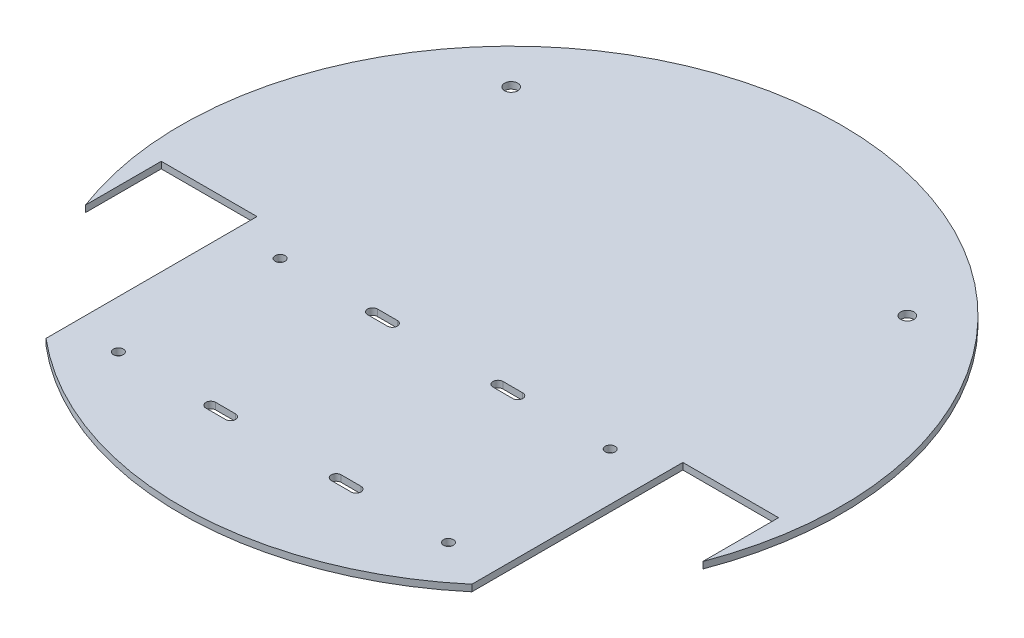
ISO-10303-21;
HEADER;
FILE_DESCRIPTION(('STEP AP214'),'2;1');
FILE_NAME('part.step','',(''),(''),'','','');
FILE_SCHEMA(('AUTOMOTIVE_DESIGN { 1 0 10303 214 1 1 1 1 }'));
ENDSEC;
DATA;
#1=APPLICATION_CONTEXT('core data for automotive mechanical design processes');
#2=APPLICATION_PROTOCOL_DEFINITION('international standard','automotive_design',2000,#1);
#3=PRODUCT_CONTEXT('',#1,'mechanical');
#4=PRODUCT('Part','Part','',(#3));
#5=PRODUCT_RELATED_PRODUCT_CATEGORY('part','',(#4));
#6=PRODUCT_DEFINITION_FORMATION('','',#4);
#7=PRODUCT_DEFINITION_CONTEXT('part definition',#1,'design');
#8=PRODUCT_DEFINITION('design','',#6,#7);
#9=PRODUCT_DEFINITION_SHAPE('','',#8);
#10=(LENGTH_UNIT() NAMED_UNIT(*) SI_UNIT(.MILLI.,.METRE.));
#11=(NAMED_UNIT(*) PLANE_ANGLE_UNIT() SI_UNIT($,.RADIAN.));
#12=(NAMED_UNIT(*) SI_UNIT($,.STERADIAN.) SOLID_ANGLE_UNIT());
#13=UNCERTAINTY_MEASURE_WITH_UNIT(LENGTH_MEASURE(1.E-05),#10,'distance_accuracy_value','');
#14=(GEOMETRIC_REPRESENTATION_CONTEXT(3) GLOBAL_UNCERTAINTY_ASSIGNED_CONTEXT((#13)) GLOBAL_UNIT_ASSIGNED_CONTEXT((#10,
#11,#12)) REPRESENTATION_CONTEXT('',''));
#15=CARTESIAN_POINT('',(0.,0.,0.));
#16=DIRECTION('',(0.,0.,1.));
#17=DIRECTION('',(1.,0.,0.));
#18=AXIS2_PLACEMENT_3D('',#15,#16,#17);
#19=CARTESIAN_POINT('',(22.0000000000001,2.,69.));
#20=DIRECTION('',(0.,-1.,0.));
#21=DIRECTION('',(0.,0.,-1.));
#22=AXIS2_PLACEMENT_3D('',#19,#20,#21);
#23=CYLINDRICAL_SURFACE('',#22,1.49999999999999);
#24=CARTESIAN_POINT('',(22.0000000000001,0.,69.));
#25=DIRECTION('',(0.,1.,0.));
#26=DIRECTION('',(0.,0.,1.));
#27=AXIS2_PLACEMENT_3D('',#24,#25,#26);
#28=CIRCLE('',#27,1.49999999999999);
#29=CARTESIAN_POINT('',(22.0000000000001,0.,70.5));
#30=VERTEX_POINT('',#29);
#31=CARTESIAN_POINT('',(22.0000000000001,0.,67.5));
#32=VERTEX_POINT('',#31);
#33=EDGE_CURVE('E303',#30,#32,#28,.T.);
#34=ORIENTED_EDGE('',*,*,#33,.F.);
#35=DIRECTION('',(0.,-1.,0.));
#36=VECTOR('',#35,1.);
#37=CARTESIAN_POINT('',(22.0000000000001,2.,70.5));
#38=LINE('',#37,#36);
#39=CARTESIAN_POINT('',(22.0000000000001,2.,70.5));
#40=VERTEX_POINT('',#39);
#41=EDGE_CURVE('E11',#40,#30,#38,.T.);
#42=ORIENTED_EDGE('',*,*,#41,.F.);
#43=CARTESIAN_POINT('',(22.0000000000001,2.,69.));
#44=DIRECTION('',(0.,1.,0.));
#45=DIRECTION('',(0.,0.,1.));
#46=AXIS2_PLACEMENT_3D('',#43,#44,#45);
#47=CIRCLE('',#46,1.49999999999999);
#48=CARTESIAN_POINT('',(22.0000000000001,2.,67.5));
#49=VERTEX_POINT('',#48);
#50=EDGE_CURVE('E221',#40,#49,#47,.T.);
#51=ORIENTED_EDGE('',*,*,#50,.T.);
#52=DIRECTION('',(0.,-1.,0.));
#53=VECTOR('',#52,1.);
#54=CARTESIAN_POINT('',(22.0000000000001,2.,67.5));
#55=LINE('',#54,#53);
#56=EDGE_CURVE('E136',#49,#32,#55,.T.);
#57=ORIENTED_EDGE('',*,*,#56,.T.);
#58=EDGE_LOOP('',(#34,#42,#51,#57));
#59=FACE_BOUND('',#58,.T.);
#60=ADVANCED_FACE('F35',(#59),#23,.F.);
#61=CARTESIAN_POINT('',(0.,2.,70.5));
#62=DIRECTION('',(0.,0.,-1.));
#63=DIRECTION('',(-1.,0.,0.));
#64=AXIS2_PLACEMENT_3D('',#61,#62,#63);
#65=PLANE('',#64);
#66=DIRECTION('',(1.,0.,0.));
#67=VECTOR('',#66,1.);
#68=CARTESIAN_POINT('',(0.,0.,70.5));
#69=LINE('',#68,#67);
#70=CARTESIAN_POINT('',(16.0000000000001,0.,70.5));
#71=VERTEX_POINT('',#70);
#72=EDGE_CURVE('E212',#71,#30,#69,.T.);
#73=ORIENTED_EDGE('',*,*,#72,.F.);
#74=DIRECTION('',(0.,-1.,0.));
#75=VECTOR('',#74,1.);
#76=CARTESIAN_POINT('',(16.0000000000001,2.,70.5));
#77=LINE('',#76,#75);
#78=CARTESIAN_POINT('',(16.0000000000001,2.,70.5));
#79=VERTEX_POINT('',#78);
#80=EDGE_CURVE('E45',#79,#71,#77,.T.);
#81=ORIENTED_EDGE('',*,*,#80,.F.);
#82=DIRECTION('',(1.,0.,0.));
#83=VECTOR('',#82,1.);
#84=CARTESIAN_POINT('',(0.,2.,70.5));
#85=LINE('',#84,#83);
#86=EDGE_CURVE('E210',#79,#40,#85,.T.);
#87=ORIENTED_EDGE('',*,*,#86,.T.);
#88=ORIENTED_EDGE('',*,*,#41,.T.);
#89=EDGE_LOOP('',(#73,#81,#87,#88));
#90=FACE_BOUND('',#89,.T.);
#91=ADVANCED_FACE('F209',(#90),#65,.T.);
#92=CARTESIAN_POINT('',(16.,2.,69.));
#93=DIRECTION('',(0.,-1.,0.));
#94=DIRECTION('',(0.,0.,-1.));
#95=AXIS2_PLACEMENT_3D('',#92,#93,#94);
#96=CYLINDRICAL_SURFACE('',#95,1.49999999999999);
#97=CARTESIAN_POINT('',(16.,0.,69.));
#98=DIRECTION('',(0.,1.,0.));
#99=DIRECTION('',(0.,0.,1.));
#100=AXIS2_PLACEMENT_3D('',#97,#98,#99);
#101=CIRCLE('',#100,1.49999999999999);
#102=CARTESIAN_POINT('',(16.0000000000001,0.,67.5));
#103=VERTEX_POINT('',#102);
#104=EDGE_CURVE('E307',#103,#71,#101,.T.);
#105=ORIENTED_EDGE('',*,*,#104,.F.);
#106=DIRECTION('',(0.,-1.,0.));
#107=VECTOR('',#106,1.);
#108=CARTESIAN_POINT('',(16.0000000000001,2.,67.5));
#109=LINE('',#108,#107);
#110=CARTESIAN_POINT('',(16.0000000000001,2.,67.5));
#111=VERTEX_POINT('',#110);
#112=EDGE_CURVE('E129',#111,#103,#109,.T.);
#113=ORIENTED_EDGE('',*,*,#112,.F.);
#114=CARTESIAN_POINT('',(16.,2.,69.));
#115=DIRECTION('',(0.,1.,0.));
#116=DIRECTION('',(0.,0.,1.));
#117=AXIS2_PLACEMENT_3D('',#114,#115,#116);
#118=CIRCLE('',#117,1.49999999999999);
#119=EDGE_CURVE('E220',#111,#79,#118,.T.);
#120=ORIENTED_EDGE('',*,*,#119,.T.);
#121=ORIENTED_EDGE('',*,*,#80,.T.);
#122=EDGE_LOOP('',(#105,#113,#120,#121));
#123=FACE_BOUND('',#122,.T.);
#124=ADVANCED_FACE('F223',(#123),#96,.F.);
#125=CARTESIAN_POINT('',(-22.,2.,20.));
#126=DIRECTION('',(0.,-1.,0.));
#127=DIRECTION('',(0.,0.,-1.));
#128=AXIS2_PLACEMENT_3D('',#125,#126,#127);
#129=CYLINDRICAL_SURFACE('',#128,1.5);
#130=CARTESIAN_POINT('',(-22.,0.,20.));
#131=DIRECTION('',(0.,1.,0.));
#132=DIRECTION('',(0.,0.,1.));
#133=AXIS2_PLACEMENT_3D('',#130,#131,#132);
#134=CIRCLE('',#133,1.5);
#135=CARTESIAN_POINT('',(-22.,0.,18.5));
#136=VERTEX_POINT('',#135);
#137=CARTESIAN_POINT('',(-22.,0.,21.5));
#138=VERTEX_POINT('',#137);
#139=EDGE_CURVE('E291',#136,#138,#134,.T.);
#140=ORIENTED_EDGE('',*,*,#139,.F.);
#141=DIRECTION('',(0.,-1.,0.));
#142=VECTOR('',#141,1.);
#143=CARTESIAN_POINT('',(-22.,2.,18.5));
#144=LINE('',#143,#142);
#145=CARTESIAN_POINT('',(-22.,2.,18.5));
#146=VERTEX_POINT('',#145);
#147=EDGE_CURVE('E325',#146,#136,#144,.T.);
#148=ORIENTED_EDGE('',*,*,#147,.F.);
#149=CARTESIAN_POINT('',(-22.,2.,20.));
#150=DIRECTION('',(0.,1.,0.));
#151=DIRECTION('',(0.,0.,1.));
#152=AXIS2_PLACEMENT_3D('',#149,#150,#151);
#153=CIRCLE('',#152,1.5);
#154=CARTESIAN_POINT('',(-22.,2.,21.5));
#155=VERTEX_POINT('',#154);
#156=EDGE_CURVE('E447',#146,#155,#153,.T.);
#157=ORIENTED_EDGE('',*,*,#156,.T.);
#158=DIRECTION('',(0.,-1.,0.));
#159=VECTOR('',#158,1.);
#160=CARTESIAN_POINT('',(-22.,2.,21.5));
#161=LINE('',#160,#159);
#162=EDGE_CURVE('E327',#155,#138,#161,.T.);
#163=ORIENTED_EDGE('',*,*,#162,.T.);
#164=EDGE_LOOP('',(#140,#148,#157,#163));
#165=FACE_BOUND('',#164,.T.);
#166=ADVANCED_FACE('F490',(#165),#129,.F.);
#167=CARTESIAN_POINT('',(0.,2.,18.5));
#168=DIRECTION('',(0.,0.,1.));
#169=DIRECTION('',(1.,0.,0.));
#170=AXIS2_PLACEMENT_3D('',#167,#168,#169);
#171=PLANE('',#170);
#172=DIRECTION('',(-1.,0.,0.));
#173=VECTOR('',#172,1.);
#174=CARTESIAN_POINT('',(0.,0.,18.5));
#175=LINE('',#174,#173);
#176=CARTESIAN_POINT('',(-16.,0.,18.5));
#177=VERTEX_POINT('',#176);
#178=EDGE_CURVE('E294',#177,#136,#175,.T.);
#179=ORIENTED_EDGE('',*,*,#178,.F.);
#180=DIRECTION('',(0.,-1.,0.));
#181=VECTOR('',#180,1.);
#182=CARTESIAN_POINT('',(-16.,2.,18.5));
#183=LINE('',#182,#181);
#184=CARTESIAN_POINT('',(-16.,2.,18.5));
#185=VERTEX_POINT('',#184);
#186=EDGE_CURVE('E332',#185,#177,#183,.T.);
#187=ORIENTED_EDGE('',*,*,#186,.F.);
#188=DIRECTION('',(-1.,0.,0.));
#189=VECTOR('',#188,1.);
#190=CARTESIAN_POINT('',(0.,2.,18.5));
#191=LINE('',#190,#189);
#192=EDGE_CURVE('E450',#185,#146,#191,.T.);
#193=ORIENTED_EDGE('',*,*,#192,.T.);
#194=ORIENTED_EDGE('',*,*,#147,.T.);
#195=EDGE_LOOP('',(#179,#187,#193,#194));
#196=FACE_BOUND('',#195,.T.);
#197=ADVANCED_FACE('F486',(#196),#171,.T.);
#198=CARTESIAN_POINT('',(-16.,2.,20.));
#199=DIRECTION('',(0.,-1.,0.));
#200=DIRECTION('',(0.,0.,-1.));
#201=AXIS2_PLACEMENT_3D('',#198,#199,#200);
#202=CYLINDRICAL_SURFACE('',#201,1.5);
#203=CARTESIAN_POINT('',(-16.,0.,20.));
#204=DIRECTION('',(0.,1.,0.));
#205=DIRECTION('',(0.,0.,1.));
#206=AXIS2_PLACEMENT_3D('',#203,#204,#205);
#207=CIRCLE('',#206,1.5);
#208=CARTESIAN_POINT('',(-16.,0.,21.5));
#209=VERTEX_POINT('',#208);
#210=EDGE_CURVE('E297',#209,#177,#207,.T.);
#211=ORIENTED_EDGE('',*,*,#210,.F.);
#212=DIRECTION('',(0.,-1.,0.));
#213=VECTOR('',#212,1.);
#214=CARTESIAN_POINT('',(-16.,2.,21.5));
#215=LINE('',#214,#213);
#216=CARTESIAN_POINT('',(-16.,2.,21.5));
#217=VERTEX_POINT('',#216);
#218=EDGE_CURVE('E329',#217,#209,#215,.T.);
#219=ORIENTED_EDGE('',*,*,#218,.F.);
#220=CARTESIAN_POINT('',(-16.,2.,20.));
#221=DIRECTION('',(0.,1.,0.));
#222=DIRECTION('',(0.,0.,1.));
#223=AXIS2_PLACEMENT_3D('',#220,#221,#222);
#224=CIRCLE('',#223,1.5);
#225=EDGE_CURVE('E453',#217,#185,#224,.T.);
#226=ORIENTED_EDGE('',*,*,#225,.T.);
#227=ORIENTED_EDGE('',*,*,#186,.T.);
#228=EDGE_LOOP('',(#211,#219,#226,#227));
#229=FACE_BOUND('',#228,.T.);
#230=ADVANCED_FACE('F482',(#229),#202,.F.);
#231=CARTESIAN_POINT('',(0.,2.,70.5));
#232=DIRECTION('',(0.,0.,1.));
#233=DIRECTION('',(1.,0.,0.));
#234=AXIS2_PLACEMENT_3D('',#231,#232,#233);
#235=PLANE('',#234);
#236=DIRECTION('',(-1.,0.,0.));
#237=VECTOR('',#236,1.);
#238=CARTESIAN_POINT('',(0.,0.,70.5));
#239=LINE('',#238,#237);
#240=CARTESIAN_POINT('',(-16.,0.,70.5));
#241=VERTEX_POINT('',#240);
#242=CARTESIAN_POINT('',(-22.,0.,70.5));
#243=VERTEX_POINT('',#242);
#244=EDGE_CURVE('E280',#241,#243,#239,.T.);
#245=ORIENTED_EDGE('',*,*,#244,.T.);
#246=DIRECTION('',(0.,-1.,0.));
#247=VECTOR('',#246,1.);
#248=CARTESIAN_POINT('',(-22.,2.,70.5));
#249=LINE('',#248,#247);
#250=CARTESIAN_POINT('',(-22.,2.,70.5));
#251=VERTEX_POINT('',#250);
#252=EDGE_CURVE('E330',#251,#243,#249,.T.);
#253=ORIENTED_EDGE('',*,*,#252,.F.);
#254=DIRECTION('',(-1.,0.,0.));
#255=VECTOR('',#254,1.);
#256=CARTESIAN_POINT('',(0.,2.,70.5));
#257=LINE('',#256,#255);
#258=CARTESIAN_POINT('',(-16.,2.,70.5));
#259=VERTEX_POINT('',#258);
#260=EDGE_CURVE('E437',#259,#251,#257,.T.);
#261=ORIENTED_EDGE('',*,*,#260,.F.);
#262=DIRECTION('',(0.,-1.,0.));
#263=VECTOR('',#262,1.);
#264=CARTESIAN_POINT('',(-16.,2.,70.5));
#265=LINE('',#264,#263);
#266=EDGE_CURVE('E335',#259,#241,#265,.T.);
#267=ORIENTED_EDGE('',*,*,#266,.T.);
#268=EDGE_LOOP('',(#245,#253,#261,#267));
#269=FACE_BOUND('',#268,.T.);
#270=ADVANCED_FACE('F485',(#269),#235,.F.);
#271=CARTESIAN_POINT('',(-22.,2.,69.));
#272=DIRECTION('',(0.,-1.,0.));
#273=DIRECTION('',(0.,0.,-1.));
#274=AXIS2_PLACEMENT_3D('',#271,#272,#273);
#275=CYLINDRICAL_SURFACE('',#274,1.49999999999999);
#276=CARTESIAN_POINT('',(-22.,0.,69.));
#277=DIRECTION('',(0.,1.,0.));
#278=DIRECTION('',(0.,0.,1.));
#279=AXIS2_PLACEMENT_3D('',#276,#277,#278);
#280=CIRCLE('',#279,1.49999999999999);
#281=CARTESIAN_POINT('',(-22.,0.,67.5));
#282=VERTEX_POINT('',#281);
#283=EDGE_CURVE('E283',#243,#282,#280,.F.);
#284=ORIENTED_EDGE('',*,*,#283,.T.);
#285=DIRECTION('',(0.,-1.,0.));
#286=VECTOR('',#285,1.);
#287=CARTESIAN_POINT('',(-22.,2.,67.5));
#288=LINE('',#287,#286);
#289=CARTESIAN_POINT('',(-22.,2.,67.5));
#290=VERTEX_POINT('',#289);
#291=EDGE_CURVE('E341',#290,#282,#288,.T.);
#292=ORIENTED_EDGE('',*,*,#291,.F.);
#293=CARTESIAN_POINT('',(-22.,2.,69.));
#294=DIRECTION('',(0.,1.,0.));
#295=DIRECTION('',(0.,0.,1.));
#296=AXIS2_PLACEMENT_3D('',#293,#294,#295);
#297=CIRCLE('',#296,1.49999999999999);
#298=EDGE_CURVE('E440',#251,#290,#297,.F.);
#299=ORIENTED_EDGE('',*,*,#298,.F.);
#300=ORIENTED_EDGE('',*,*,#252,.T.);
#301=EDGE_LOOP('',(#284,#292,#299,#300));
#302=FACE_BOUND('',#301,.T.);
#303=ADVANCED_FACE('F503',(#302),#275,.F.);
#304=CARTESIAN_POINT('',(0.,2.,67.5));
#305=DIRECTION('',(0.,0.,1.));
#306=DIRECTION('',(1.,0.,0.));
#307=AXIS2_PLACEMENT_3D('',#304,#305,#306);
#308=PLANE('',#307);
#309=DIRECTION('',(-1.,0.,0.));
#310=VECTOR('',#309,1.);
#311=CARTESIAN_POINT('',(0.,0.,67.5));
#312=LINE('',#311,#310);
#313=CARTESIAN_POINT('',(-16.,0.,67.5));
#314=VERTEX_POINT('',#313);
#315=EDGE_CURVE('E286',#314,#282,#312,.T.);
#316=ORIENTED_EDGE('',*,*,#315,.F.);
#317=DIRECTION('',(0.,-1.,0.));
#318=VECTOR('',#317,1.);
#319=CARTESIAN_POINT('',(-16.,2.,67.5));
#320=LINE('',#319,#318);
#321=CARTESIAN_POINT('',(-16.,2.,67.5));
#322=VERTEX_POINT('',#321);
#323=EDGE_CURVE('E338',#322,#314,#320,.T.);
#324=ORIENTED_EDGE('',*,*,#323,.F.);
#325=DIRECTION('',(-1.,0.,0.));
#326=VECTOR('',#325,1.);
#327=CARTESIAN_POINT('',(0.,2.,67.5));
#328=LINE('',#327,#326);
#329=EDGE_CURVE('E442',#322,#290,#328,.T.);
#330=ORIENTED_EDGE('',*,*,#329,.T.);
#331=ORIENTED_EDGE('',*,*,#291,.T.);
#332=EDGE_LOOP('',(#316,#324,#330,#331));
#333=FACE_BOUND('',#332,.T.);
#334=ADVANCED_FACE('F499',(#333),#308,.T.);
#335=CARTESIAN_POINT('',(0.,2.,18.5));
#336=DIRECTION('',(0.,0.,-1.));
#337=DIRECTION('',(-1.,0.,0.));
#338=AXIS2_PLACEMENT_3D('',#335,#336,#337);
#339=PLANE('',#338);
#340=DIRECTION('',(1.,0.,0.));
#341=VECTOR('',#340,1.);
#342=CARTESIAN_POINT('',(0.,0.,18.5));
#343=LINE('',#342,#341);
#344=CARTESIAN_POINT('',(16.0000000000001,0.,18.5));
#345=VERTEX_POINT('',#344);
#346=CARTESIAN_POINT('',(22.0000000000001,0.,18.5));
#347=VERTEX_POINT('',#346);
#348=EDGE_CURVE('E263',#345,#347,#343,.T.);
#349=ORIENTED_EDGE('',*,*,#348,.T.);
#350=DIRECTION('',(0.,-1.,0.));
#351=VECTOR('',#350,1.);
#352=CARTESIAN_POINT('',(22.0000000000001,2.,18.5));
#353=LINE('',#352,#351);
#354=CARTESIAN_POINT('',(22.0000000000001,2.,18.5));
#355=VERTEX_POINT('',#354);
#356=EDGE_CURVE('E339',#355,#347,#353,.T.);
#357=ORIENTED_EDGE('',*,*,#356,.F.);
#358=DIRECTION('',(1.,0.,0.));
#359=VECTOR('',#358,1.);
#360=CARTESIAN_POINT('',(0.,2.,18.5));
#361=LINE('',#360,#359);
#362=CARTESIAN_POINT('',(16.0000000000001,2.,18.5));
#363=VERTEX_POINT('',#362);
#364=EDGE_CURVE('E421',#363,#355,#361,.T.);
#365=ORIENTED_EDGE('',*,*,#364,.F.);
#366=DIRECTION('',(0.,-1.,0.));
#367=VECTOR('',#366,1.);
#368=CARTESIAN_POINT('',(16.0000000000001,2.,18.5));
#369=LINE('',#368,#367);
#370=EDGE_CURVE('E345',#363,#345,#369,.T.);
#371=ORIENTED_EDGE('',*,*,#370,.T.);
#372=EDGE_LOOP('',(#349,#357,#365,#371));
#373=FACE_BOUND('',#372,.T.);
#374=ADVANCED_FACE('F502',(#373),#339,.F.);
#375=CARTESIAN_POINT('',(22.0000000000001,2.,20.));
#376=DIRECTION('',(0.,-1.,0.));
#377=DIRECTION('',(0.,0.,-1.));
#378=AXIS2_PLACEMENT_3D('',#375,#376,#377);
#379=CYLINDRICAL_SURFACE('',#378,1.49999999999999);
#380=CARTESIAN_POINT('',(22.0000000000001,0.,20.));
#381=DIRECTION('',(0.,1.,0.));
#382=DIRECTION('',(0.,0.,1.));
#383=AXIS2_PLACEMENT_3D('',#380,#381,#382);
#384=CIRCLE('',#383,1.49999999999999);
#385=CARTESIAN_POINT('',(22.0000000000001,0.,21.5));
#386=VERTEX_POINT('',#385);
#387=EDGE_CURVE('E266',#347,#386,#384,.F.);
#388=ORIENTED_EDGE('',*,*,#387,.T.);
#389=DIRECTION('',(0.,-1.,0.));
#390=VECTOR('',#389,1.);
#391=CARTESIAN_POINT('',(22.0000000000001,2.,21.5));
#392=LINE('',#391,#390);
#393=CARTESIAN_POINT('',(22.0000000000001,2.,21.5));
#394=VERTEX_POINT('',#393);
#395=EDGE_CURVE('E350',#394,#386,#392,.T.);
#396=ORIENTED_EDGE('',*,*,#395,.F.);
#397=CARTESIAN_POINT('',(22.0000000000001,2.,20.));
#398=DIRECTION('',(0.,1.,0.));
#399=DIRECTION('',(0.,0.,1.));
#400=AXIS2_PLACEMENT_3D('',#397,#398,#399);
#401=CIRCLE('',#400,1.49999999999999);
#402=EDGE_CURVE('E424',#355,#394,#401,.F.);
#403=ORIENTED_EDGE('',*,*,#402,.F.);
#404=ORIENTED_EDGE('',*,*,#356,.T.);
#405=EDGE_LOOP('',(#388,#396,#403,#404));
#406=FACE_BOUND('',#405,.T.);
#407=ADVANCED_FACE('F525',(#406),#379,.F.);
#408=CARTESIAN_POINT('',(0.,2.,21.5));
#409=DIRECTION('',(0.,0.,-1.));
#410=DIRECTION('',(-1.,0.,0.));
#411=AXIS2_PLACEMENT_3D('',#408,#409,#410);
#412=PLANE('',#411);
#413=DIRECTION('',(1.,0.,0.));
#414=VECTOR('',#413,1.);
#415=CARTESIAN_POINT('',(0.,0.,21.5));
#416=LINE('',#415,#414);
#417=CARTESIAN_POINT('',(16.0000000000001,0.,21.5));
#418=VERTEX_POINT('',#417);
#419=EDGE_CURVE('E269',#418,#386,#416,.T.);
#420=ORIENTED_EDGE('',*,*,#419,.F.);
#421=DIRECTION('',(0.,-1.,0.));
#422=VECTOR('',#421,1.);
#423=CARTESIAN_POINT('',(16.0000000000001,2.,21.5));
#424=LINE('',#423,#422);
#425=CARTESIAN_POINT('',(16.0000000000001,2.,21.5));
#426=VERTEX_POINT('',#425);
#427=EDGE_CURVE('E348',#426,#418,#424,.T.);
#428=ORIENTED_EDGE('',*,*,#427,.F.);
#429=DIRECTION('',(1.,0.,0.));
#430=VECTOR('',#429,1.);
#431=CARTESIAN_POINT('',(0.,2.,21.5));
#432=LINE('',#431,#430);
#433=EDGE_CURVE('E426',#426,#394,#432,.T.);
#434=ORIENTED_EDGE('',*,*,#433,.T.);
#435=ORIENTED_EDGE('',*,*,#395,.T.);
#436=EDGE_LOOP('',(#420,#428,#434,#435));
#437=FACE_BOUND('',#436,.T.);
#438=ADVANCED_FACE('F522',(#437),#412,.T.);
#439=CARTESIAN_POINT('',(93.5,2.,-1.13005537547703E-13));
#440=DIRECTION('',(1.,0.,0.));
#441=DIRECTION('',(0.,0.,-1.));
#442=AXIS2_PLACEMENT_3D('',#439,#440,#441);
#443=PLANE('',#442);
#444=DIRECTION('',(0.,0.,1.));
#445=VECTOR('',#444,1.);
#446=CARTESIAN_POINT('',(93.5,0.,-1.13005537547703E-13));
#447=LINE('',#446,#445);
#448=CARTESIAN_POINT('',(93.5,0.,12.5));
#449=VERTEX_POINT('',#448);
#450=CARTESIAN_POINT('',(93.5,0.,35.4647712526107));
#451=VERTEX_POINT('',#450);
#452=EDGE_CURVE('E241',#449,#451,#447,.T.);
#453=ORIENTED_EDGE('',*,*,#452,.T.);
#454=DIRECTION('',(0.,-1.,0.));
#455=VECTOR('',#454,1.);
#456=CARTESIAN_POINT('',(93.5,2.,35.4647712526107));
#457=LINE('',#456,#455);
#458=CARTESIAN_POINT('',(93.5,2.,35.4647712526107));
#459=VERTEX_POINT('',#458);
#460=EDGE_CURVE('E39',#459,#451,#457,.T.);
#461=ORIENTED_EDGE('',*,*,#460,.F.);
#462=DIRECTION('',(0.,0.,1.));
#463=VECTOR('',#462,1.);
#464=CARTESIAN_POINT('',(93.5,2.,-1.13005537547703E-13));
#465=LINE('',#464,#463);
#466=CARTESIAN_POINT('',(93.5,2.,12.5));
#467=VERTEX_POINT('',#466);
#468=EDGE_CURVE('E323',#467,#459,#465,.T.);
#469=ORIENTED_EDGE('',*,*,#468,.F.);
#470=DIRECTION('',(0.,-1.,0.));
#471=VECTOR('',#470,1.);
#472=CARTESIAN_POINT('',(93.5,2.,12.5));
#473=LINE('',#472,#471);
#474=EDGE_CURVE('E240',#467,#449,#473,.T.);
#475=ORIENTED_EDGE('',*,*,#474,.T.);
#476=EDGE_LOOP('',(#453,#461,#469,#475));
#477=FACE_BOUND('',#476,.T.);
#478=ADVANCED_FACE('F37',(#477),#443,.F.);
#479=CARTESIAN_POINT('',(0.,2.,0.));
#480=DIRECTION('',(0.,-1.,0.));
#481=DIRECTION('',(0.,0.,-1.));
#482=AXIS2_PLACEMENT_3D('',#479,#480,#481);
#483=CYLINDRICAL_SURFACE('',#482,100.);
#484=CARTESIAN_POINT('',(0.,0.,0.));
#485=DIRECTION('',(0.,1.,0.));
#486=DIRECTION('',(0.,0.,1.));
#487=AXIS2_PLACEMENT_3D('',#484,#485,#486);
#488=CIRCLE('',#487,100.);
#489=CARTESIAN_POINT('',(-93.5,0.,35.4647712526107));
#490=VERTEX_POINT('',#489);
#491=EDGE_CURVE('E244',#451,#490,#488,.T.);
#492=ORIENTED_EDGE('',*,*,#491,.T.);
#493=DIRECTION('',(0.,-1.,0.));
#494=VECTOR('',#493,1.);
#495=CARTESIAN_POINT('',(-93.5,2.,35.4647712526107));
#496=LINE('',#495,#494);
#497=CARTESIAN_POINT('',(-93.5,2.,35.4647712526107));
#498=VERTEX_POINT('',#497);
#499=EDGE_CURVE('E366',#498,#490,#496,.T.);
#500=ORIENTED_EDGE('',*,*,#499,.F.);
#501=CARTESIAN_POINT('',(0.,2.,0.));
#502=DIRECTION('',(0.,1.,0.));
#503=DIRECTION('',(0.,0.,1.));
#504=AXIS2_PLACEMENT_3D('',#501,#502,#503);
#505=CIRCLE('',#504,100.);
#506=EDGE_CURVE('E144',#459,#498,#505,.T.);
#507=ORIENTED_EDGE('',*,*,#506,.F.);
#508=ORIENTED_EDGE('',*,*,#460,.T.);
#509=EDGE_LOOP('',(#492,#500,#507,#508));
#510=FACE_BOUND('',#509,.T.);
#511=ADVANCED_FACE('F371',(#510),#483,.T.);
#512=CARTESIAN_POINT('',(-93.5,2.,-1.13005537547703E-13));
#513=DIRECTION('',(1.,0.,0.));
#514=DIRECTION('',(0.,0.,-1.));
#515=AXIS2_PLACEMENT_3D('',#512,#513,#514);
#516=PLANE('',#515);
#517=DIRECTION('',(0.,0.,1.));
#518=VECTOR('',#517,1.);
#519=CARTESIAN_POINT('',(-93.5,0.,-1.13005537547703E-13));
#520=LINE('',#519,#518);
#521=CARTESIAN_POINT('',(-93.5,0.,12.5));
#522=VERTEX_POINT('',#521);
#523=EDGE_CURVE('E247',#522,#490,#520,.T.);
#524=ORIENTED_EDGE('',*,*,#523,.F.);
#525=DIRECTION('',(0.,-1.,0.));
#526=VECTOR('',#525,1.);
#527=CARTESIAN_POINT('',(-93.5,2.,12.5));
#528=LINE('',#527,#526);
#529=CARTESIAN_POINT('',(-93.5,2.,12.5));
#530=VERTEX_POINT('',#529);
#531=EDGE_CURVE('E365',#530,#522,#528,.T.);
#532=ORIENTED_EDGE('',*,*,#531,.F.);
#533=DIRECTION('',(0.,0.,1.));
#534=VECTOR('',#533,1.);
#535=CARTESIAN_POINT('',(-93.5,2.,-1.13005537547703E-13));
#536=LINE('',#535,#534);
#537=EDGE_CURVE('E409',#530,#498,#536,.T.);
#538=ORIENTED_EDGE('',*,*,#537,.T.);
#539=ORIENTED_EDGE('',*,*,#499,.T.);
#540=EDGE_LOOP('',(#524,#532,#538,#539));
#541=FACE_BOUND('',#540,.T.);
#542=ADVANCED_FACE('F408',(#541),#516,.T.);
#543=CARTESIAN_POINT('',(0.,2.,12.5));
#544=DIRECTION('',(0.,0.,-1.));
#545=DIRECTION('',(-1.,0.,0.));
#546=AXIS2_PLACEMENT_3D('',#543,#544,#545);
#547=PLANE('',#546);
#548=DIRECTION('',(1.,0.,0.));
#549=VECTOR('',#548,1.);
#550=CARTESIAN_POINT('',(0.,0.,12.5));
#551=LINE('',#550,#549);
#552=CARTESIAN_POINT('',(-64.5,0.,12.5));
#553=VERTEX_POINT('',#552);
#554=EDGE_CURVE('E250',#522,#553,#551,.T.);
#555=ORIENTED_EDGE('',*,*,#554,.T.);
#556=DIRECTION('',(0.,-1.,0.));
#557=VECTOR('',#556,1.);
#558=CARTESIAN_POINT('',(-64.5,2.,12.5));
#559=LINE('',#558,#557);
#560=CARTESIAN_POINT('',(-64.5,2.,12.5));
#561=VERTEX_POINT('',#560);
#562=EDGE_CURVE('E362',#561,#553,#559,.T.);
#563=ORIENTED_EDGE('',*,*,#562,.F.);
#564=DIRECTION('',(1.,0.,0.));
#565=VECTOR('',#564,1.);
#566=CARTESIAN_POINT('',(0.,2.,12.5));
#567=LINE('',#566,#565);
#568=EDGE_CURVE('E406',#530,#561,#567,.T.);
#569=ORIENTED_EDGE('',*,*,#568,.F.);
#570=ORIENTED_EDGE('',*,*,#531,.T.);
#571=EDGE_LOOP('',(#555,#563,#569,#570));
#572=FACE_BOUND('',#571,.T.);
#573=ADVANCED_FACE('F405',(#572),#547,.F.);
#574=CARTESIAN_POINT('',(-64.5,2.,0.));
#575=DIRECTION('',(1.,0.,0.));
#576=DIRECTION('',(0.,0.,-1.));
#577=AXIS2_PLACEMENT_3D('',#574,#575,#576);
#578=PLANE('',#577);
#579=DIRECTION('',(0.,0.,1.));
#580=VECTOR('',#579,1.);
#581=CARTESIAN_POINT('',(-64.5,0.,0.));
#582=LINE('',#581,#580);
#583=CARTESIAN_POINT('',(-64.5,0.,76.4182569809074));
#584=VERTEX_POINT('',#583);
#585=EDGE_CURVE('E252',#553,#584,#582,.T.);
#586=ORIENTED_EDGE('',*,*,#585,.T.);
#587=DIRECTION('',(0.,-1.,0.));
#588=VECTOR('',#587,1.);
#589=CARTESIAN_POINT('',(-64.5,2.,76.4182569809074));
#590=LINE('',#589,#588);
#591=CARTESIAN_POINT('',(-64.5,2.,76.4182569809074));
#592=VERTEX_POINT('',#591);
#593=EDGE_CURVE('E359',#592,#584,#590,.T.);
#594=ORIENTED_EDGE('',*,*,#593,.F.);
#595=DIRECTION('',(0.,0.,1.));
#596=VECTOR('',#595,1.);
#597=CARTESIAN_POINT('',(-64.5,2.,0.));
#598=LINE('',#597,#596);
#599=EDGE_CURVE('E401',#561,#592,#598,.T.);
#600=ORIENTED_EDGE('',*,*,#599,.F.);
#601=ORIENTED_EDGE('',*,*,#562,.T.);
#602=EDGE_LOOP('',(#586,#594,#600,#601));
#603=FACE_BOUND('',#602,.T.);
#604=ADVANCED_FACE('F400',(#603),#578,.F.);
#605=CARTESIAN_POINT('',(0.,2.,0.));
#606=DIRECTION('',(0.,-1.,0.));
#607=DIRECTION('',(0.,0.,-1.));
#608=AXIS2_PLACEMENT_3D('',#605,#606,#607);
#609=CYLINDRICAL_SURFACE('',#608,100.);
#610=CARTESIAN_POINT('',(0.,0.,0.));
#611=DIRECTION('',(0.,1.,0.));
#612=DIRECTION('',(0.,0.,1.));
#613=AXIS2_PLACEMENT_3D('',#610,#611,#612);
#614=CIRCLE('',#613,100.);
#615=CARTESIAN_POINT('',(64.5,0.,76.4182569809074));
#616=VERTEX_POINT('',#615);
#617=EDGE_CURVE('E254',#584,#616,#614,.T.);
#618=ORIENTED_EDGE('',*,*,#617,.T.);
#619=DIRECTION('',(0.,-1.,0.));
#620=VECTOR('',#619,1.);
#621=CARTESIAN_POINT('',(64.5,2.,76.4182569809074));
#622=LINE('',#621,#620);
#623=CARTESIAN_POINT('',(64.5,2.,76.4182569809074));
#624=VERTEX_POINT('',#623);
#625=EDGE_CURVE('E357',#624,#616,#622,.T.);
#626=ORIENTED_EDGE('',*,*,#625,.F.);
#627=CARTESIAN_POINT('',(0.,2.,0.));
#628=DIRECTION('',(0.,1.,0.));
#629=DIRECTION('',(0.,0.,1.));
#630=AXIS2_PLACEMENT_3D('',#627,#628,#629);
#631=CIRCLE('',#630,100.);
#632=EDGE_CURVE('E397',#592,#624,#631,.T.);
#633=ORIENTED_EDGE('',*,*,#632,.F.);
#634=ORIENTED_EDGE('',*,*,#593,.T.);
#635=EDGE_LOOP('',(#618,#626,#633,#634));
#636=FACE_BOUND('',#635,.T.);
#637=ADVANCED_FACE('F394',(#636),#609,.T.);
#638=CARTESIAN_POINT('',(64.5,2.,0.));
#639=DIRECTION('',(1.,0.,0.));
#640=DIRECTION('',(0.,0.,-1.));
#641=AXIS2_PLACEMENT_3D('',#638,#639,#640);
#642=PLANE('',#641);
#643=DIRECTION('',(0.,0.,1.));
#644=VECTOR('',#643,1.);
#645=CARTESIAN_POINT('',(64.5,0.,0.));
#646=LINE('',#645,#644);
#647=CARTESIAN_POINT('',(64.5,0.,12.5));
#648=VERTEX_POINT('',#647);
#649=EDGE_CURVE('E257',#648,#616,#646,.T.);
#650=ORIENTED_EDGE('',*,*,#649,.F.);
#651=DIRECTION('',(0.,-1.,0.));
#652=VECTOR('',#651,1.);
#653=CARTESIAN_POINT('',(64.5,2.,12.5));
#654=LINE('',#653,#652);
#655=CARTESIAN_POINT('',(64.5,2.,12.5));
#656=VERTEX_POINT('',#655);
#657=EDGE_CURVE('E355',#656,#648,#654,.T.);
#658=ORIENTED_EDGE('',*,*,#657,.F.);
#659=DIRECTION('',(0.,0.,1.));
#660=VECTOR('',#659,1.);
#661=CARTESIAN_POINT('',(64.5,2.,0.));
#662=LINE('',#661,#660);
#663=EDGE_CURVE('E418',#656,#624,#662,.T.);
#664=ORIENTED_EDGE('',*,*,#663,.T.);
#665=ORIENTED_EDGE('',*,*,#625,.T.);
#666=EDGE_LOOP('',(#650,#658,#664,#665));
#667=FACE_BOUND('',#666,.T.);
#668=ADVANCED_FACE('F388',(#667),#642,.T.);
#669=CARTESIAN_POINT('',(-60.,2.,-60.));
#670=DIRECTION('',(0.,-1.,0.));
#671=DIRECTION('',(0.,0.,-1.));
#672=AXIS2_PLACEMENT_3D('',#669,#670,#671);
#673=CYLINDRICAL_SURFACE('',#672,2.);
#674=CARTESIAN_POINT('',(-60.,2.,-60.));
#675=DIRECTION('',(0.,1.,0.));
#676=DIRECTION('',(0.,0.,1.));
#677=AXIS2_PLACEMENT_3D('',#674,#675,#676);
#678=CIRCLE('',#677,2.);
#679=CARTESIAN_POINT('',(-60.,2.,-58.));
#680=VERTEX_POINT('',#679);
#681=EDGE_CURVE('E234',#680,#680,#678,.T.);
#682=ORIENTED_EDGE('',*,*,#681,.T.);
#683=EDGE_LOOP('',(#682));
#684=FACE_BOUND('',#683,.T.);
#685=CARTESIAN_POINT('',(-60.,0.,-60.));
#686=DIRECTION('',(0.,1.,0.));
#687=DIRECTION('',(0.,0.,1.));
#688=AXIS2_PLACEMENT_3D('',#685,#686,#687);
#689=CIRCLE('',#688,2.);
#690=CARTESIAN_POINT('',(-60.,0.,-58.));
#691=VERTEX_POINT('',#690);
#692=EDGE_CURVE('E317',#691,#691,#689,.T.);
#693=ORIENTED_EDGE('',*,*,#692,.F.);
#694=EDGE_LOOP('',(#693));
#695=FACE_BOUND('',#694,.T.);
#696=ADVANCED_FACE('F538',(#684,#695),#673,.F.);
#697=CARTESIAN_POINT('',(50.,2.,20.));
#698=DIRECTION('',(0.,-1.,0.));
#699=DIRECTION('',(0.,0.,-1.));
#700=AXIS2_PLACEMENT_3D('',#697,#698,#699);
#701=CYLINDRICAL_SURFACE('',#700,1.5);
#702=CARTESIAN_POINT('',(50.,2.,20.));
#703=DIRECTION('',(0.,1.,0.));
#704=DIRECTION('',(0.,0.,1.));
#705=AXIS2_PLACEMENT_3D('',#702,#703,#704);
#706=CIRCLE('',#705,1.5);
#707=CARTESIAN_POINT('',(50.,2.,21.5));
#708=VERTEX_POINT('',#707);
#709=EDGE_CURVE('E231',#708,#708,#706,.F.);
#710=ORIENTED_EDGE('',*,*,#709,.F.);
#711=EDGE_LOOP('',(#710));
#712=FACE_BOUND('',#711,.T.);
#713=CARTESIAN_POINT('',(50.,0.,20.));
#714=DIRECTION('',(0.,1.,0.));
#715=DIRECTION('',(0.,0.,1.));
#716=AXIS2_PLACEMENT_3D('',#713,#714,#715);
#717=CIRCLE('',#716,1.5);
#718=CARTESIAN_POINT('',(50.,0.,21.5));
#719=VERTEX_POINT('',#718);
#720=EDGE_CURVE('E314',#719,#719,#717,.F.);
#721=ORIENTED_EDGE('',*,*,#720,.T.);
#722=EDGE_LOOP('',(#721));
#723=FACE_BOUND('',#722,.T.);
#724=ADVANCED_FACE('F471',(#712,#723),#701,.F.);
#725=CARTESIAN_POINT('',(50.,2.,69.));
#726=DIRECTION('',(0.,-1.,0.));
#727=DIRECTION('',(0.,0.,-1.));
#728=AXIS2_PLACEMENT_3D('',#725,#726,#727);
#729=CYLINDRICAL_SURFACE('',#728,1.5);
#730=CARTESIAN_POINT('',(50.,2.,69.));
#731=DIRECTION('',(0.,1.,0.));
#732=DIRECTION('',(0.,0.,1.));
#733=AXIS2_PLACEMENT_3D('',#730,#731,#732);
#734=CIRCLE('',#733,1.5);
#735=CARTESIAN_POINT('',(50.,2.,70.5));
#736=VERTEX_POINT('',#735);
#737=EDGE_CURVE('E225',#736,#736,#734,.T.);
#738=ORIENTED_EDGE('',*,*,#737,.T.);
#739=EDGE_LOOP('',(#738));
#740=FACE_BOUND('',#739,.T.);
#741=CARTESIAN_POINT('',(50.,0.,69.));
#742=DIRECTION('',(0.,1.,0.));
#743=DIRECTION('',(0.,0.,1.));
#744=AXIS2_PLACEMENT_3D('',#741,#742,#743);
#745=CIRCLE('',#744,1.5);
#746=CARTESIAN_POINT('',(50.,0.,70.5));
#747=VERTEX_POINT('',#746);
#748=EDGE_CURVE('E311',#747,#747,#745,.T.);
#749=ORIENTED_EDGE('',*,*,#748,.F.);
#750=EDGE_LOOP('',(#749));
#751=FACE_BOUND('',#750,.T.);
#752=ADVANCED_FACE('F462',(#740,#751),#729,.F.);
#753=CARTESIAN_POINT('',(0.,2.,67.5));
#754=DIRECTION('',(0.,0.,-1.));
#755=DIRECTION('',(-1.,0.,0.));
#756=AXIS2_PLACEMENT_3D('',#753,#754,#755);
#757=PLANE('',#756);
#758=DIRECTION('',(1.,0.,0.));
#759=VECTOR('',#758,1.);
#760=CARTESIAN_POINT('',(0.,0.,67.5));
#761=LINE('',#760,#759);
#762=EDGE_CURVE('E309',#103,#32,#761,.T.);
#763=ORIENTED_EDGE('',*,*,#762,.T.);
#764=ORIENTED_EDGE('',*,*,#56,.F.);
#765=DIRECTION('',(1.,0.,0.));
#766=VECTOR('',#765,1.);
#767=CARTESIAN_POINT('',(0.,2.,67.5));
#768=LINE('',#767,#766);
#769=EDGE_CURVE('E54',#111,#49,#768,.T.);
#770=ORIENTED_EDGE('',*,*,#769,.F.);
#771=ORIENTED_EDGE('',*,*,#112,.T.);
#772=EDGE_LOOP('',(#763,#764,#770,#771));
#773=FACE_BOUND('',#772,.T.);
#774=ADVANCED_FACE('F459',(#773),#757,.F.);
#775=CARTESIAN_POINT('',(0.,2.,21.5));
#776=DIRECTION('',(0.,0.,1.));
#777=DIRECTION('',(1.,0.,0.));
#778=AXIS2_PLACEMENT_3D('',#775,#776,#777);
#779=PLANE('',#778);
#780=DIRECTION('',(-1.,0.,0.));
#781=VECTOR('',#780,1.);
#782=CARTESIAN_POINT('',(0.,0.,21.5));
#783=LINE('',#782,#781);
#784=EDGE_CURVE('E300',#209,#138,#783,.T.);
#785=ORIENTED_EDGE('',*,*,#784,.T.);
#786=ORIENTED_EDGE('',*,*,#162,.F.);
#787=DIRECTION('',(-1.,0.,0.));
#788=VECTOR('',#787,1.);
#789=CARTESIAN_POINT('',(0.,2.,21.5));
#790=LINE('',#789,#788);
#791=EDGE_CURVE('E456',#217,#155,#790,.T.);
#792=ORIENTED_EDGE('',*,*,#791,.F.);
#793=ORIENTED_EDGE('',*,*,#218,.T.);
#794=EDGE_LOOP('',(#785,#786,#792,#793));
#795=FACE_BOUND('',#794,.T.);
#796=ADVANCED_FACE('F461',(#795),#779,.F.);
#797=CARTESIAN_POINT('',(-16.,2.,69.));
#798=DIRECTION('',(0.,-1.,0.));
#799=DIRECTION('',(0.,0.,-1.));
#800=AXIS2_PLACEMENT_3D('',#797,#798,#799);
#801=CYLINDRICAL_SURFACE('',#800,1.49999999999999);
#802=CARTESIAN_POINT('',(-16.,0.,69.));
#803=DIRECTION('',(0.,1.,0.));
#804=DIRECTION('',(0.,0.,1.));
#805=AXIS2_PLACEMENT_3D('',#802,#803,#804);
#806=CIRCLE('',#805,1.49999999999999);
#807=EDGE_CURVE('E289',#314,#241,#806,.F.);
#808=ORIENTED_EDGE('',*,*,#807,.T.);
#809=ORIENTED_EDGE('',*,*,#266,.F.);
#810=CARTESIAN_POINT('',(-16.,2.,69.));
#811=DIRECTION('',(0.,1.,0.));
#812=DIRECTION('',(0.,0.,1.));
#813=AXIS2_PLACEMENT_3D('',#810,#811,#812);
#814=CIRCLE('',#813,1.49999999999999);
#815=EDGE_CURVE('E445',#322,#259,#814,.F.);
#816=ORIENTED_EDGE('',*,*,#815,.F.);
#817=ORIENTED_EDGE('',*,*,#323,.T.);
#818=EDGE_LOOP('',(#808,#809,#816,#817));
#819=FACE_BOUND('',#818,.T.);
#820=ADVANCED_FACE('F468',(#819),#801,.F.);
#821=CARTESIAN_POINT('',(-50.,2.,20.));
#822=DIRECTION('',(0.,-1.,0.));
#823=DIRECTION('',(0.,0.,-1.));
#824=AXIS2_PLACEMENT_3D('',#821,#822,#823);
#825=CYLINDRICAL_SURFACE('',#824,1.5);
#826=CARTESIAN_POINT('',(-50.,2.,20.));
#827=DIRECTION('',(0.,1.,0.));
#828=DIRECTION('',(0.,0.,1.));
#829=AXIS2_PLACEMENT_3D('',#826,#827,#828);
#830=CIRCLE('',#829,1.5);
#831=CARTESIAN_POINT('',(-50.,2.,21.5));
#832=VERTEX_POINT('',#831);
#833=EDGE_CURVE('E434',#832,#832,#830,.T.);
#834=ORIENTED_EDGE('',*,*,#833,.T.);
#835=EDGE_LOOP('',(#834));
#836=FACE_BOUND('',#835,.T.);
#837=CARTESIAN_POINT('',(-50.,0.,20.));
#838=DIRECTION('',(0.,1.,0.));
#839=DIRECTION('',(0.,0.,1.));
#840=AXIS2_PLACEMENT_3D('',#837,#838,#839);
#841=CIRCLE('',#840,1.5);
#842=CARTESIAN_POINT('',(-50.,0.,21.5));
#843=VERTEX_POINT('',#842);
#844=EDGE_CURVE('E277',#843,#843,#841,.T.);
#845=ORIENTED_EDGE('',*,*,#844,.F.);
#846=EDGE_LOOP('',(#845));
#847=FACE_BOUND('',#846,.T.);
#848=ADVANCED_FACE('F497',(#836,#847),#825,.F.);
#849=CARTESIAN_POINT('',(-50.,2.,69.));
#850=DIRECTION('',(0.,-1.,0.));
#851=DIRECTION('',(0.,0.,-1.));
#852=AXIS2_PLACEMENT_3D('',#849,#850,#851);
#853=CYLINDRICAL_SURFACE('',#852,1.5);
#854=CARTESIAN_POINT('',(-50.,2.,69.));
#855=DIRECTION('',(0.,1.,0.));
#856=DIRECTION('',(0.,0.,1.));
#857=AXIS2_PLACEMENT_3D('',#854,#855,#856);
#858=CIRCLE('',#857,1.5);
#859=CARTESIAN_POINT('',(-50.,2.,70.5));
#860=VERTEX_POINT('',#859);
#861=EDGE_CURVE('E431',#860,#860,#858,.F.);
#862=ORIENTED_EDGE('',*,*,#861,.F.);
#863=EDGE_LOOP('',(#862));
#864=FACE_BOUND('',#863,.T.);
#865=CARTESIAN_POINT('',(-50.,0.,69.));
#866=DIRECTION('',(0.,1.,0.));
#867=DIRECTION('',(0.,0.,1.));
#868=AXIS2_PLACEMENT_3D('',#865,#866,#867);
#869=CIRCLE('',#868,1.5);
#870=CARTESIAN_POINT('',(-50.,0.,70.5));
#871=VERTEX_POINT('',#870);
#872=EDGE_CURVE('E274',#871,#871,#869,.F.);
#873=ORIENTED_EDGE('',*,*,#872,.T.);
#874=EDGE_LOOP('',(#873));
#875=FACE_BOUND('',#874,.T.);
#876=ADVANCED_FACE('F513',(#864,#875),#853,.F.);
#877=CARTESIAN_POINT('',(16.,2.,20.));
#878=DIRECTION('',(0.,-1.,0.));
#879=DIRECTION('',(0.,0.,-1.));
#880=AXIS2_PLACEMENT_3D('',#877,#878,#879);
#881=CYLINDRICAL_SURFACE('',#880,1.49999999999999);
#882=CARTESIAN_POINT('',(16.,0.,20.));
#883=DIRECTION('',(0.,1.,0.));
#884=DIRECTION('',(0.,0.,1.));
#885=AXIS2_PLACEMENT_3D('',#882,#883,#884);
#886=CIRCLE('',#885,1.49999999999999);
#887=EDGE_CURVE('E272',#418,#345,#886,.F.);
#888=ORIENTED_EDGE('',*,*,#887,.T.);
#889=ORIENTED_EDGE('',*,*,#370,.F.);
#890=CARTESIAN_POINT('',(16.,2.,20.));
#891=DIRECTION('',(0.,1.,0.));
#892=DIRECTION('',(0.,0.,1.));
#893=AXIS2_PLACEMENT_3D('',#890,#891,#892);
#894=CIRCLE('',#893,1.49999999999999);
#895=EDGE_CURVE('E429',#426,#363,#894,.F.);
#896=ORIENTED_EDGE('',*,*,#895,.F.);
#897=ORIENTED_EDGE('',*,*,#427,.T.);
#898=EDGE_LOOP('',(#888,#889,#896,#897));
#899=FACE_BOUND('',#898,.T.);
#900=ADVANCED_FACE('F517',(#899),#881,.F.);
#901=CARTESIAN_POINT('',(0.,2.,12.5000000000001));
#902=DIRECTION('',(0.,0.,1.));
#903=DIRECTION('',(1.,0.,0.));
#904=AXIS2_PLACEMENT_3D('',#901,#902,#903);
#905=PLANE('',#904);
#906=DIRECTION('',(-1.,0.,0.));
#907=VECTOR('',#906,1.);
#908=CARTESIAN_POINT('',(0.,0.,12.5000000000001));
#909=LINE('',#908,#907);
#910=EDGE_CURVE('E260',#449,#648,#909,.T.);
#911=ORIENTED_EDGE('',*,*,#910,.F.);
#912=ORIENTED_EDGE('',*,*,#474,.F.);
#913=DIRECTION('',(-1.,0.,0.));
#914=VECTOR('',#913,1.);
#915=CARTESIAN_POINT('',(0.,2.,12.5000000000001));
#916=LINE('',#915,#914);
#917=EDGE_CURVE('E384',#467,#656,#916,.T.);
#918=ORIENTED_EDGE('',*,*,#917,.T.);
#919=ORIENTED_EDGE('',*,*,#657,.T.);
#920=EDGE_LOOP('',(#911,#912,#918,#919));
#921=FACE_BOUND('',#920,.T.);
#922=ADVANCED_FACE('F380',(#921),#905,.T.);
#923=CARTESIAN_POINT('',(60.,2.,-60.));
#924=DIRECTION('',(0.,-1.,0.));
#925=DIRECTION('',(0.,0.,-1.));
#926=AXIS2_PLACEMENT_3D('',#923,#924,#925);
#927=CYLINDRICAL_SURFACE('',#926,2.);
#928=CARTESIAN_POINT('',(60.,2.,-60.));
#929=DIRECTION('',(0.,1.,0.));
#930=DIRECTION('',(0.,0.,1.));
#931=AXIS2_PLACEMENT_3D('',#928,#929,#930);
#932=CIRCLE('',#931,2.);
#933=CARTESIAN_POINT('',(60.,2.,-58.));
#934=VERTEX_POINT('',#933);
#935=EDGE_CURVE('E237',#934,#934,#932,.F.);
#936=ORIENTED_EDGE('',*,*,#935,.F.);
#937=EDGE_LOOP('',(#936));
#938=FACE_BOUND('',#937,.T.);
#939=CARTESIAN_POINT('',(60.,0.,-60.));
#940=DIRECTION('',(0.,1.,0.));
#941=DIRECTION('',(0.,0.,1.));
#942=AXIS2_PLACEMENT_3D('',#939,#940,#941);
#943=CIRCLE('',#942,2.);
#944=CARTESIAN_POINT('',(60.,0.,-58.));
#945=VERTEX_POINT('',#944);
#946=EDGE_CURVE('E320',#945,#945,#943,.F.);
#947=ORIENTED_EDGE('',*,*,#946,.T.);
#948=EDGE_LOOP('',(#947));
#949=FACE_BOUND('',#948,.T.);
#950=ADVANCED_FACE('F535',(#938,#949),#927,.F.);
#951=CARTESIAN_POINT('',(0.,2.,0.));
#952=DIRECTION('',(0.,1.,0.));
#953=DIRECTION('',(0.,0.,1.));
#954=AXIS2_PLACEMENT_3D('',#951,#952,#953);
#955=PLANE('',#954);
#956=ORIENTED_EDGE('',*,*,#468,.T.);
#957=ORIENTED_EDGE('',*,*,#506,.T.);
#958=ORIENTED_EDGE('',*,*,#537,.F.);
#959=ORIENTED_EDGE('',*,*,#568,.T.);
#960=ORIENTED_EDGE('',*,*,#599,.T.);
#961=ORIENTED_EDGE('',*,*,#632,.T.);
#962=ORIENTED_EDGE('',*,*,#663,.F.);
#963=ORIENTED_EDGE('',*,*,#917,.F.);
#964=EDGE_LOOP('',(#956,#957,#958,#959,#960,#961,#962,#963));
#965=FACE_BOUND('',#964,.T.);
#966=ORIENTED_EDGE('',*,*,#364,.T.);
#967=ORIENTED_EDGE('',*,*,#402,.T.);
#968=ORIENTED_EDGE('',*,*,#433,.F.);
#969=ORIENTED_EDGE('',*,*,#895,.T.);
#970=EDGE_LOOP('',(#966,#967,#968,#969));
#971=FACE_BOUND('',#970,.T.);
#972=ORIENTED_EDGE('',*,*,#861,.T.);
#973=EDGE_LOOP('',(#972));
#974=FACE_BOUND('',#973,.T.);
#975=ORIENTED_EDGE('',*,*,#833,.F.);
#976=EDGE_LOOP('',(#975));
#977=FACE_BOUND('',#976,.T.);
#978=ORIENTED_EDGE('',*,*,#260,.T.);
#979=ORIENTED_EDGE('',*,*,#298,.T.);
#980=ORIENTED_EDGE('',*,*,#329,.F.);
#981=ORIENTED_EDGE('',*,*,#815,.T.);
#982=EDGE_LOOP('',(#978,#979,#980,#981));
#983=FACE_BOUND('',#982,.T.);
#984=ORIENTED_EDGE('',*,*,#156,.F.);
#985=ORIENTED_EDGE('',*,*,#192,.F.);
#986=ORIENTED_EDGE('',*,*,#225,.F.);
#987=ORIENTED_EDGE('',*,*,#791,.T.);
#988=EDGE_LOOP('',(#984,#985,#986,#987));
#989=FACE_BOUND('',#988,.T.);
#990=ORIENTED_EDGE('',*,*,#50,.F.);
#991=ORIENTED_EDGE('',*,*,#86,.F.);
#992=ORIENTED_EDGE('',*,*,#119,.F.);
#993=ORIENTED_EDGE('',*,*,#769,.T.);
#994=EDGE_LOOP('',(#990,#991,#992,#993));
#995=FACE_BOUND('',#994,.T.);
#996=ORIENTED_EDGE('',*,*,#737,.F.);
#997=EDGE_LOOP('',(#996));
#998=FACE_BOUND('',#997,.T.);
#999=ORIENTED_EDGE('',*,*,#709,.T.);
#1000=EDGE_LOOP('',(#999));
#1001=FACE_BOUND('',#1000,.T.);
#1002=ORIENTED_EDGE('',*,*,#681,.F.);
#1003=EDGE_LOOP('',(#1002));
#1004=FACE_BOUND('',#1003,.T.);
#1005=ORIENTED_EDGE('',*,*,#935,.T.);
#1006=EDGE_LOOP('',(#1005));
#1007=FACE_BOUND('',#1006,.T.);
#1008=ADVANCED_FACE('F218',(#965,#971,#974,#977,#983,#989,#995,#998,#1001,#1004,#1007),#955,.T.);
#1009=CARTESIAN_POINT('',(0.,0.,0.));
#1010=DIRECTION('',(0.,1.,0.));
#1011=DIRECTION('',(0.,0.,1.));
#1012=AXIS2_PLACEMENT_3D('',#1009,#1010,#1011);
#1013=PLANE('',#1012);
#1014=ORIENTED_EDGE('',*,*,#452,.F.);
#1015=ORIENTED_EDGE('',*,*,#910,.T.);
#1016=ORIENTED_EDGE('',*,*,#649,.T.);
#1017=ORIENTED_EDGE('',*,*,#617,.F.);
#1018=ORIENTED_EDGE('',*,*,#585,.F.);
#1019=ORIENTED_EDGE('',*,*,#554,.F.);
#1020=ORIENTED_EDGE('',*,*,#523,.T.);
#1021=ORIENTED_EDGE('',*,*,#491,.F.);
#1022=EDGE_LOOP('',(#1014,#1015,#1016,#1017,#1018,#1019,#1020,#1021));
#1023=FACE_BOUND('',#1022,.T.);
#1024=ORIENTED_EDGE('',*,*,#348,.F.);
#1025=ORIENTED_EDGE('',*,*,#887,.F.);
#1026=ORIENTED_EDGE('',*,*,#419,.T.);
#1027=ORIENTED_EDGE('',*,*,#387,.F.);
#1028=EDGE_LOOP('',(#1024,#1025,#1026,#1027));
#1029=FACE_BOUND('',#1028,.T.);
#1030=ORIENTED_EDGE('',*,*,#872,.F.);
#1031=EDGE_LOOP('',(#1030));
#1032=FACE_BOUND('',#1031,.T.);
#1033=ORIENTED_EDGE('',*,*,#844,.T.);
#1034=EDGE_LOOP('',(#1033));
#1035=FACE_BOUND('',#1034,.T.);
#1036=ORIENTED_EDGE('',*,*,#244,.F.);
#1037=ORIENTED_EDGE('',*,*,#807,.F.);
#1038=ORIENTED_EDGE('',*,*,#315,.T.);
#1039=ORIENTED_EDGE('',*,*,#283,.F.);
#1040=EDGE_LOOP('',(#1036,#1037,#1038,#1039));
#1041=FACE_BOUND('',#1040,.T.);
#1042=ORIENTED_EDGE('',*,*,#139,.T.);
#1043=ORIENTED_EDGE('',*,*,#784,.F.);
#1044=ORIENTED_EDGE('',*,*,#210,.T.);
#1045=ORIENTED_EDGE('',*,*,#178,.T.);
#1046=EDGE_LOOP('',(#1042,#1043,#1044,#1045));
#1047=FACE_BOUND('',#1046,.T.);
#1048=ORIENTED_EDGE('',*,*,#33,.T.);
#1049=ORIENTED_EDGE('',*,*,#762,.F.);
#1050=ORIENTED_EDGE('',*,*,#104,.T.);
#1051=ORIENTED_EDGE('',*,*,#72,.T.);
#1052=EDGE_LOOP('',(#1048,#1049,#1050,#1051));
#1053=FACE_BOUND('',#1052,.T.);
#1054=ORIENTED_EDGE('',*,*,#748,.T.);
#1055=EDGE_LOOP('',(#1054));
#1056=FACE_BOUND('',#1055,.T.);
#1057=ORIENTED_EDGE('',*,*,#720,.F.);
#1058=EDGE_LOOP('',(#1057));
#1059=FACE_BOUND('',#1058,.T.);
#1060=ORIENTED_EDGE('',*,*,#692,.T.);
#1061=EDGE_LOOP('',(#1060));
#1062=FACE_BOUND('',#1061,.T.);
#1063=ORIENTED_EDGE('',*,*,#946,.F.);
#1064=EDGE_LOOP('',(#1063));
#1065=FACE_BOUND('',#1064,.T.);
#1066=ADVANCED_FACE('F377',(#1023,#1029,#1032,#1035,#1041,#1047,#1053,#1056,#1059,#1062,#1065),
#1013,.F.);
#1067=CLOSED_SHELL('',(#60,#91,#124,#166,#197,#230,#270,#303,#334,#374,#407,#438,#478,#511,#542,
#573,#604,#637,#668,#696,#724,#752,#774,#796,#820,#848,#876,#900,#922,#950,#1008,#1066));
#1068=MANIFOLD_SOLID_BREP('B2',#1067);
#1069=ADVANCED_BREP_SHAPE_REPRESENTATION('',(#18,#1068),#14);
#1070=SHAPE_DEFINITION_REPRESENTATION(#9,#1069);
ENDSEC;
END-ISO-10303-21;
